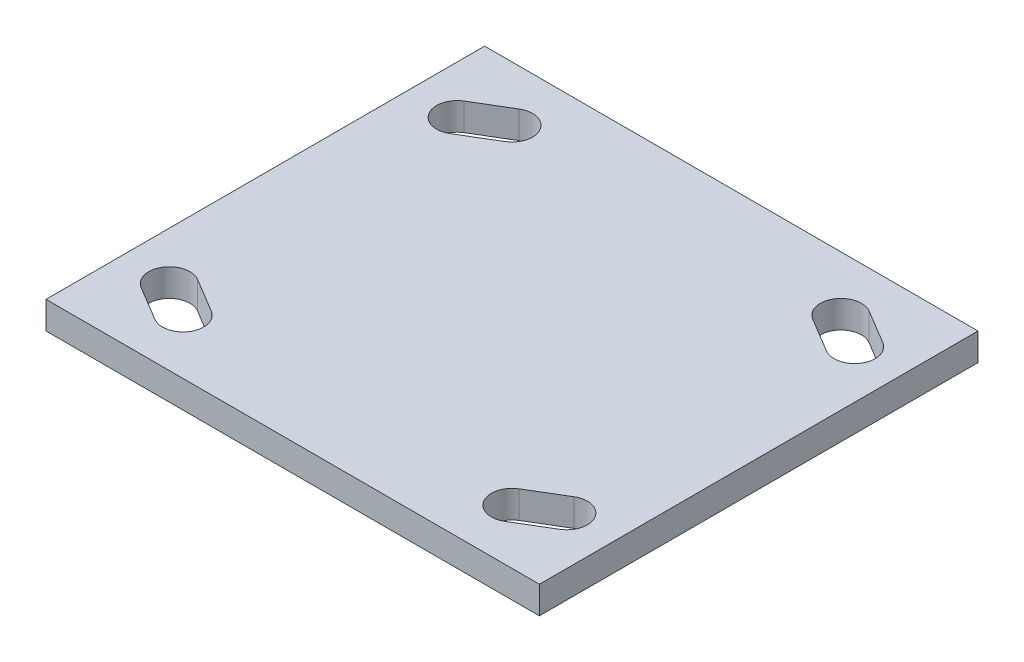
ISO-10303-21;
HEADER;
FILE_DESCRIPTION(('STEP AP214'),'2;1');
FILE_NAME('part.step','',(''),(''),'','','');
FILE_SCHEMA(('AUTOMOTIVE_DESIGN { 1 0 10303 214 1 1 1 1 }'));
ENDSEC;
DATA;
#1=APPLICATION_CONTEXT('core data for automotive mechanical design processes');
#2=APPLICATION_PROTOCOL_DEFINITION('international standard','automotive_design',2000,#1);
#3=PRODUCT_CONTEXT('',#1,'mechanical');
#4=PRODUCT('Part','Part','',(#3));
#5=PRODUCT_RELATED_PRODUCT_CATEGORY('part','',(#4));
#6=PRODUCT_DEFINITION_FORMATION('','',#4);
#7=PRODUCT_DEFINITION_CONTEXT('part definition',#1,'design');
#8=PRODUCT_DEFINITION('design','',#6,#7);
#9=PRODUCT_DEFINITION_SHAPE('','',#8);
#10=(LENGTH_UNIT() NAMED_UNIT(*) SI_UNIT(.MILLI.,.METRE.));
#11=(NAMED_UNIT(*) PLANE_ANGLE_UNIT() SI_UNIT($,.RADIAN.));
#12=(NAMED_UNIT(*) SI_UNIT($,.STERADIAN.) SOLID_ANGLE_UNIT());
#13=UNCERTAINTY_MEASURE_WITH_UNIT(LENGTH_MEASURE(1.E-05),#10,'distance_accuracy_value','');
#14=(GEOMETRIC_REPRESENTATION_CONTEXT(3) GLOBAL_UNCERTAINTY_ASSIGNED_CONTEXT((#13)) GLOBAL_UNIT_ASSIGNED_CONTEXT((#10,
#11,#12)) REPRESENTATION_CONTEXT('',''));
#15=CARTESIAN_POINT('',(0.,0.,0.));
#16=DIRECTION('',(0.,0.,1.));
#17=DIRECTION('',(1.,0.,0.));
#18=AXIS2_PLACEMENT_3D('',#15,#16,#17);
#19=CARTESIAN_POINT('',(-57.15,0.,50.8));
#20=DIRECTION('',(1.,0.,0.));
#21=DIRECTION('',(0.,0.,-1.));
#22=AXIS2_PLACEMENT_3D('',#19,#20,#21);
#23=PLANE('',#22);
#24=DIRECTION('',(0.,-1.,0.));
#25=VECTOR('',#24,1.);
#26=CARTESIAN_POINT('',(-57.15,0.,-50.8));
#27=LINE('',#26,#25);
#28=CARTESIAN_POINT('',(-57.15,0.,-50.8));
#29=VERTEX_POINT('',#28);
#30=CARTESIAN_POINT('',(-57.15,-6.35,-50.8));
#31=VERTEX_POINT('',#30);
#32=EDGE_CURVE('E298',#29,#31,#27,.T.);
#33=ORIENTED_EDGE('',*,*,#32,.T.);
#34=DIRECTION('',(0.,0.,-1.));
#35=VECTOR('',#34,1.);
#36=CARTESIAN_POINT('',(-57.15,-6.35,50.8));
#37=LINE('',#36,#35);
#38=CARTESIAN_POINT('',(-57.15,-6.35,50.8));
#39=VERTEX_POINT('',#38);
#40=EDGE_CURVE('E11',#39,#31,#37,.T.);
#41=ORIENTED_EDGE('',*,*,#40,.F.);
#42=DIRECTION('',(0.,-1.,0.));
#43=VECTOR('',#42,1.);
#44=CARTESIAN_POINT('',(-57.15,0.,50.8));
#45=LINE('',#44,#43);
#46=CARTESIAN_POINT('',(-57.15,0.,50.8));
#47=VERTEX_POINT('',#46);
#48=EDGE_CURVE('E305',#47,#39,#45,.T.);
#49=ORIENTED_EDGE('',*,*,#48,.F.);
#50=DIRECTION('',(0.,0.,-1.));
#51=VECTOR('',#50,1.);
#52=CARTESIAN_POINT('',(-57.15,0.,50.8));
#53=LINE('',#52,#51);
#54=EDGE_CURVE('E315',#47,#29,#53,.T.);
#55=ORIENTED_EDGE('',*,*,#54,.T.);
#56=EDGE_LOOP('',(#33,#41,#49,#55));
#57=FACE_BOUND('',#56,.T.);
#58=ADVANCED_FACE('F36',(#57),#23,.F.);
#59=CARTESIAN_POINT('',(-57.15,-6.35,50.8));
#60=DIRECTION('',(0.,1.,0.));
#61=DIRECTION('',(0.,0.,1.));
#62=AXIS2_PLACEMENT_3D('',#59,#60,#61);
#63=PLANE('',#62);
#64=DIRECTION('',(-0.857492925712546,0.,0.514495755427524));
#65=VECTOR('',#64,1.);
#66=CARTESIAN_POINT('',(35.6497139647764,-6.35,34.016189941294));
#67=LINE('',#66,#65);
#68=CARTESIAN_POINT('',(43.5872139647764,-6.35,29.253689941294));
#69=VERTEX_POINT('',#68);
#70=CARTESIAN_POINT('',(35.6497139647764,-6.35,34.016189941294));
#71=VERTEX_POINT('',#70);
#72=EDGE_CURVE('E180',#69,#71,#67,.T.);
#73=ORIENTED_EDGE('',*,*,#72,.T.);
#74=CARTESIAN_POINT('',(38.1,-6.35,38.1));
#75=DIRECTION('',(0.,1.,0.));
#76=DIRECTION('',(0.,0.,1.));
#77=AXIS2_PLACEMENT_3D('',#74,#75,#76);
#78=CIRCLE('',#77,4.76250000000001);
#79=CARTESIAN_POINT('',(40.5502860352236,-6.35,42.183810058706));
#80=VERTEX_POINT('',#79);
#81=EDGE_CURVE('E174',#71,#80,#78,.T.);
#82=ORIENTED_EDGE('',*,*,#81,.T.);
#83=DIRECTION('',(0.857492925712543,0.,-0.514495755427529));
#84=VECTOR('',#83,1.);
#85=CARTESIAN_POINT('',(40.5502860352236,-6.35,42.183810058706));
#86=LINE('',#85,#84);
#87=CARTESIAN_POINT('',(48.4877860352236,-6.35,37.421310058706));
#88=VERTEX_POINT('',#87);
#89=EDGE_CURVE('E183',#80,#88,#86,.T.);
#90=ORIENTED_EDGE('',*,*,#89,.T.);
#91=CARTESIAN_POINT('',(46.0375,-6.35,33.3375));
#92=DIRECTION('',(0.,1.,0.));
#93=DIRECTION('',(0.,0.,1.));
#94=AXIS2_PLACEMENT_3D('',#91,#92,#93);
#95=CIRCLE('',#94,4.76249999999998);
#96=EDGE_CURVE('E50',#88,#69,#95,.T.);
#97=ORIENTED_EDGE('',*,*,#96,.T.);
#98=EDGE_LOOP('',(#73,#82,#90,#97));
#99=FACE_BOUND('',#98,.T.);
#100=DIRECTION('',(-0.857492925712543,0.,-0.514495755427529));
#101=VECTOR('',#100,1.);
#102=CARTESIAN_POINT('',(40.5502860352236,-6.35,-42.183810058706));
#103=LINE('',#102,#101);
#104=CARTESIAN_POINT('',(48.4877860352236,-6.35,-37.421310058706));
#105=VERTEX_POINT('',#104);
#106=CARTESIAN_POINT('',(40.5502860352236,-6.35,-42.183810058706));
#107=VERTEX_POINT('',#106);
#108=EDGE_CURVE('E219',#105,#107,#103,.T.);
#109=ORIENTED_EDGE('',*,*,#108,.T.);
#110=CARTESIAN_POINT('',(38.1,-6.35,-38.1));
#111=DIRECTION('',(0.,1.,0.));
#112=DIRECTION('',(0.,0.,-1.));
#113=AXIS2_PLACEMENT_3D('',#110,#111,#112);
#114=CIRCLE('',#113,4.76250000000001);
#115=CARTESIAN_POINT('',(35.6497139647764,-6.35,-34.016189941294));
#116=VERTEX_POINT('',#115);
#117=EDGE_CURVE('E209',#107,#116,#114,.T.);
#118=ORIENTED_EDGE('',*,*,#117,.T.);
#119=DIRECTION('',(0.857492925712546,0.,0.514495755427524));
#120=VECTOR('',#119,1.);
#121=CARTESIAN_POINT('',(35.6497139647764,-6.35,-34.016189941294));
#122=LINE('',#121,#120);
#123=CARTESIAN_POINT('',(43.5872139647764,-6.35,-29.253689941294));
#124=VERTEX_POINT('',#123);
#125=EDGE_CURVE('E212',#116,#124,#122,.T.);
#126=ORIENTED_EDGE('',*,*,#125,.T.);
#127=CARTESIAN_POINT('',(46.0375,-6.35,-33.3375));
#128=DIRECTION('',(0.,1.,0.));
#129=DIRECTION('',(0.,0.,-1.));
#130=AXIS2_PLACEMENT_3D('',#127,#128,#129);
#131=CIRCLE('',#130,4.76249999999998);
#132=EDGE_CURVE('E216',#124,#105,#131,.T.);
#133=ORIENTED_EDGE('',*,*,#132,.T.);
#134=EDGE_LOOP('',(#109,#118,#126,#133));
#135=FACE_BOUND('',#134,.T.);
#136=DIRECTION('',(0.857492925712543,0.,0.514495755427529));
#137=VECTOR('',#136,1.);
#138=CARTESIAN_POINT('',(-40.5502860352236,-6.35,42.183810058706));
#139=LINE('',#138,#137);
#140=CARTESIAN_POINT('',(-48.4877860352236,-6.35,37.421310058706));
#141=VERTEX_POINT('',#140);
#142=CARTESIAN_POINT('',(-40.5502860352236,-6.35,42.183810058706));
#143=VERTEX_POINT('',#142);
#144=EDGE_CURVE('E251',#141,#143,#139,.T.);
#145=ORIENTED_EDGE('',*,*,#144,.T.);
#146=CARTESIAN_POINT('',(-38.1,-6.35,38.1));
#147=DIRECTION('',(0.,1.,0.));
#148=DIRECTION('',(0.,0.,-1.));
#149=AXIS2_PLACEMENT_3D('',#146,#147,#148);
#150=CIRCLE('',#149,4.76250000000001);
#151=CARTESIAN_POINT('',(-35.6497139647764,-6.35,34.016189941294));
#152=VERTEX_POINT('',#151);
#153=EDGE_CURVE('E241',#143,#152,#150,.T.);
#154=ORIENTED_EDGE('',*,*,#153,.T.);
#155=DIRECTION('',(-0.857492925712546,0.,-0.514495755427524));
#156=VECTOR('',#155,1.);
#157=CARTESIAN_POINT('',(-35.6497139647764,-6.35,34.016189941294));
#158=LINE('',#157,#156);
#159=CARTESIAN_POINT('',(-43.5872139647764,-6.35,29.253689941294));
#160=VERTEX_POINT('',#159);
#161=EDGE_CURVE('E244',#152,#160,#158,.T.);
#162=ORIENTED_EDGE('',*,*,#161,.T.);
#163=CARTESIAN_POINT('',(-46.0375,-6.35,33.3375));
#164=DIRECTION('',(0.,1.,0.));
#165=DIRECTION('',(0.,0.,-1.));
#166=AXIS2_PLACEMENT_3D('',#163,#164,#165);
#167=CIRCLE('',#166,4.76249999999998);
#168=EDGE_CURVE('E248',#160,#141,#167,.T.);
#169=ORIENTED_EDGE('',*,*,#168,.T.);
#170=EDGE_LOOP('',(#145,#154,#162,#169));
#171=FACE_BOUND('',#170,.T.);
#172=DIRECTION('',(0.857492925712546,0.,-0.514495755427524));
#173=VECTOR('',#172,1.);
#174=CARTESIAN_POINT('',(-35.6497139647764,-6.35,-34.016189941294));
#175=LINE('',#174,#173);
#176=CARTESIAN_POINT('',(-43.5872139647764,-6.35,-29.253689941294));
#177=VERTEX_POINT('',#176);
#178=CARTESIAN_POINT('',(-35.6497139647764,-6.35,-34.016189941294));
#179=VERTEX_POINT('',#178);
#180=EDGE_CURVE('E283',#177,#179,#175,.T.);
#181=ORIENTED_EDGE('',*,*,#180,.T.);
#182=CARTESIAN_POINT('',(-38.1,-6.35,-38.1));
#183=DIRECTION('',(0.,1.,0.));
#184=DIRECTION('',(0.,0.,1.));
#185=AXIS2_PLACEMENT_3D('',#182,#183,#184);
#186=CIRCLE('',#185,4.76250000000001);
#187=CARTESIAN_POINT('',(-40.5502860352236,-6.35,-42.183810058706));
#188=VERTEX_POINT('',#187);
#189=EDGE_CURVE('E273',#179,#188,#186,.T.);
#190=ORIENTED_EDGE('',*,*,#189,.T.);
#191=DIRECTION('',(-0.857492925712543,0.,0.514495755427529));
#192=VECTOR('',#191,1.);
#193=CARTESIAN_POINT('',(-40.5502860352236,-6.35,-42.183810058706));
#194=LINE('',#193,#192);
#195=CARTESIAN_POINT('',(-48.4877860352236,-6.35,-37.421310058706));
#196=VERTEX_POINT('',#195);
#197=EDGE_CURVE('E276',#188,#196,#194,.T.);
#198=ORIENTED_EDGE('',*,*,#197,.T.);
#199=CARTESIAN_POINT('',(-46.0375,-6.35,-33.3375));
#200=DIRECTION('',(0.,1.,0.));
#201=DIRECTION('',(0.,0.,1.));
#202=AXIS2_PLACEMENT_3D('',#199,#200,#201);
#203=CIRCLE('',#202,4.76249999999998);
#204=EDGE_CURVE('E280',#196,#177,#203,.T.);
#205=ORIENTED_EDGE('',*,*,#204,.T.);
#206=EDGE_LOOP('',(#181,#190,#198,#205));
#207=FACE_BOUND('',#206,.T.);
#208=DIRECTION('',(1.,0.,0.));
#209=VECTOR('',#208,1.);
#210=CARTESIAN_POINT('',(-57.15,-6.35,-50.8));
#211=LINE('',#210,#209);
#212=CARTESIAN_POINT('',(57.15,-6.35,-50.8));
#213=VERTEX_POINT('',#212);
#214=EDGE_CURVE('E318',#31,#213,#211,.T.);
#215=ORIENTED_EDGE('',*,*,#214,.T.);
#216=DIRECTION('',(0.,0.,-1.));
#217=VECTOR('',#216,1.);
#218=CARTESIAN_POINT('',(57.15,-6.35,50.8));
#219=LINE('',#218,#217);
#220=CARTESIAN_POINT('',(57.15,-6.35,50.8));
#221=VERTEX_POINT('',#220);
#222=EDGE_CURVE('E43',#221,#213,#219,.T.);
#223=ORIENTED_EDGE('',*,*,#222,.F.);
#224=DIRECTION('',(1.,0.,0.));
#225=VECTOR('',#224,1.);
#226=CARTESIAN_POINT('',(-57.15,-6.35,50.8));
#227=LINE('',#226,#225);
#228=EDGE_CURVE('E308',#39,#221,#227,.T.);
#229=ORIENTED_EDGE('',*,*,#228,.F.);
#230=ORIENTED_EDGE('',*,*,#40,.T.);
#231=EDGE_LOOP('',(#215,#223,#229,#230));
#232=FACE_BOUND('',#231,.T.);
#233=ADVANCED_FACE('F187',(#99,#135,#171,#207,#232),#63,.F.);
#234=CARTESIAN_POINT('',(57.15,0.,50.8));
#235=DIRECTION('',(-1.,0.,0.));
#236=DIRECTION('',(0.,0.,1.));
#237=AXIS2_PLACEMENT_3D('',#234,#235,#236);
#238=PLANE('',#237);
#239=DIRECTION('',(0.,1.,0.));
#240=VECTOR('',#239,1.);
#241=CARTESIAN_POINT('',(57.15,0.,-50.8));
#242=LINE('',#241,#240);
#243=CARTESIAN_POINT('',(57.15,0.,-50.8));
#244=VERTEX_POINT('',#243);
#245=EDGE_CURVE('E320',#213,#244,#242,.T.);
#246=ORIENTED_EDGE('',*,*,#245,.T.);
#247=DIRECTION('',(0.,0.,-1.));
#248=VECTOR('',#247,1.);
#249=CARTESIAN_POINT('',(57.15,0.,50.8));
#250=LINE('',#249,#248);
#251=CARTESIAN_POINT('',(57.15,0.,50.8));
#252=VERTEX_POINT('',#251);
#253=EDGE_CURVE('E325',#252,#244,#250,.T.);
#254=ORIENTED_EDGE('',*,*,#253,.F.);
#255=DIRECTION('',(0.,1.,0.));
#256=VECTOR('',#255,1.);
#257=CARTESIAN_POINT('',(57.15,0.,50.8));
#258=LINE('',#257,#256);
#259=EDGE_CURVE('E311',#221,#252,#258,.T.);
#260=ORIENTED_EDGE('',*,*,#259,.F.);
#261=ORIENTED_EDGE('',*,*,#222,.T.);
#262=EDGE_LOOP('',(#246,#254,#260,#261));
#263=FACE_BOUND('',#262,.T.);
#264=ADVANCED_FACE('F332',(#263),#238,.F.);
#265=CARTESIAN_POINT('',(-57.15,0.,50.8));
#266=DIRECTION('',(0.,-1.,0.));
#267=DIRECTION('',(0.,0.,-1.));
#268=AXIS2_PLACEMENT_3D('',#265,#266,#267);
#269=PLANE('',#268);
#270=DIRECTION('',(0.857492925712543,0.,-0.514495755427529));
#271=VECTOR('',#270,1.);
#272=CARTESIAN_POINT('',(40.5502860352236,0.,42.183810058706));
#273=LINE('',#272,#271);
#274=CARTESIAN_POINT('',(40.5502860352236,0.,42.183810058706));
#275=VERTEX_POINT('',#274);
#276=CARTESIAN_POINT('',(48.4877860352236,0.,37.421310058706));
#277=VERTEX_POINT('',#276);
#278=EDGE_CURVE('E199',#275,#277,#273,.T.);
#279=ORIENTED_EDGE('',*,*,#278,.F.);
#280=CARTESIAN_POINT('',(38.1,0.,38.1));
#281=DIRECTION('',(0.,1.,0.));
#282=DIRECTION('',(0.,0.,1.));
#283=AXIS2_PLACEMENT_3D('',#280,#281,#282);
#284=CIRCLE('',#283,4.76250000000001);
#285=CARTESIAN_POINT('',(35.6497139647764,0.,34.016189941294));
#286=VERTEX_POINT('',#285);
#287=EDGE_CURVE('E58',#286,#275,#284,.T.);
#288=ORIENTED_EDGE('',*,*,#287,.F.);
#289=DIRECTION('',(-0.857492925712546,0.,0.514495755427524));
#290=VECTOR('',#289,1.);
#291=CARTESIAN_POINT('',(35.6497139647764,0.,34.016189941294));
#292=LINE('',#291,#290);
#293=CARTESIAN_POINT('',(43.5872139647764,0.,29.253689941294));
#294=VERTEX_POINT('',#293);
#295=EDGE_CURVE('E190',#294,#286,#292,.T.);
#296=ORIENTED_EDGE('',*,*,#295,.F.);
#297=CARTESIAN_POINT('',(46.0375,0.,33.3375));
#298=DIRECTION('',(0.,1.,0.));
#299=DIRECTION('',(0.,0.,1.));
#300=AXIS2_PLACEMENT_3D('',#297,#298,#299);
#301=CIRCLE('',#300,4.76249999999998);
#302=EDGE_CURVE('E193',#277,#294,#301,.T.);
#303=ORIENTED_EDGE('',*,*,#302,.F.);
#304=EDGE_LOOP('',(#279,#288,#296,#303));
#305=FACE_BOUND('',#304,.T.);
#306=DIRECTION('',(0.857492925712546,0.,0.514495755427524));
#307=VECTOR('',#306,1.);
#308=CARTESIAN_POINT('',(35.6497139647764,0.,-34.016189941294));
#309=LINE('',#308,#307);
#310=CARTESIAN_POINT('',(35.6497139647764,0.,-34.016189941294));
#311=VERTEX_POINT('',#310);
#312=CARTESIAN_POINT('',(43.5872139647764,0.,-29.253689941294));
#313=VERTEX_POINT('',#312);
#314=EDGE_CURVE('E224',#311,#313,#309,.T.);
#315=ORIENTED_EDGE('',*,*,#314,.F.);
#316=CARTESIAN_POINT('',(38.1,0.,-38.1));
#317=DIRECTION('',(0.,1.,0.));
#318=DIRECTION('',(0.,0.,-1.));
#319=AXIS2_PLACEMENT_3D('',#316,#317,#318);
#320=CIRCLE('',#319,4.76250000000001);
#321=CARTESIAN_POINT('',(40.5502860352236,0.,-42.183810058706));
#322=VERTEX_POINT('',#321);
#323=EDGE_CURVE('E205',#322,#311,#320,.T.);
#324=ORIENTED_EDGE('',*,*,#323,.F.);
#325=DIRECTION('',(-0.857492925712543,0.,-0.514495755427529));
#326=VECTOR('',#325,1.);
#327=CARTESIAN_POINT('',(40.5502860352236,0.,-42.183810058706));
#328=LINE('',#327,#326);
#329=CARTESIAN_POINT('',(48.4877860352236,0.,-37.421310058706));
#330=VERTEX_POINT('',#329);
#331=EDGE_CURVE('E213',#330,#322,#328,.T.);
#332=ORIENTED_EDGE('',*,*,#331,.F.);
#333=CARTESIAN_POINT('',(46.0375,0.,-33.3375));
#334=DIRECTION('',(0.,1.,0.));
#335=DIRECTION('',(0.,0.,-1.));
#336=AXIS2_PLACEMENT_3D('',#333,#334,#335);
#337=CIRCLE('',#336,4.76249999999998);
#338=EDGE_CURVE('E227',#313,#330,#337,.T.);
#339=ORIENTED_EDGE('',*,*,#338,.F.);
#340=EDGE_LOOP('',(#315,#324,#332,#339));
#341=FACE_BOUND('',#340,.T.);
#342=DIRECTION('',(-0.857492925712546,0.,-0.514495755427524));
#343=VECTOR('',#342,1.);
#344=CARTESIAN_POINT('',(-35.6497139647764,0.,34.016189941294));
#345=LINE('',#344,#343);
#346=CARTESIAN_POINT('',(-35.6497139647764,0.,34.016189941294));
#347=VERTEX_POINT('',#346);
#348=CARTESIAN_POINT('',(-43.5872139647764,0.,29.253689941294));
#349=VERTEX_POINT('',#348);
#350=EDGE_CURVE('E256',#347,#349,#345,.T.);
#351=ORIENTED_EDGE('',*,*,#350,.F.);
#352=CARTESIAN_POINT('',(-38.1,0.,38.1));
#353=DIRECTION('',(0.,1.,0.));
#354=DIRECTION('',(0.,0.,-1.));
#355=AXIS2_PLACEMENT_3D('',#352,#353,#354);
#356=CIRCLE('',#355,4.76250000000001);
#357=CARTESIAN_POINT('',(-40.5502860352236,0.,42.183810058706));
#358=VERTEX_POINT('',#357);
#359=EDGE_CURVE('E234',#358,#347,#356,.T.);
#360=ORIENTED_EDGE('',*,*,#359,.F.);
#361=DIRECTION('',(0.857492925712543,0.,0.514495755427529));
#362=VECTOR('',#361,1.);
#363=CARTESIAN_POINT('',(-40.5502860352236,0.,42.183810058706));
#364=LINE('',#363,#362);
#365=CARTESIAN_POINT('',(-48.4877860352236,0.,37.421310058706));
#366=VERTEX_POINT('',#365);
#367=EDGE_CURVE('E245',#366,#358,#364,.T.);
#368=ORIENTED_EDGE('',*,*,#367,.F.);
#369=CARTESIAN_POINT('',(-46.0375,0.,33.3375));
#370=DIRECTION('',(0.,1.,0.));
#371=DIRECTION('',(0.,0.,-1.));
#372=AXIS2_PLACEMENT_3D('',#369,#370,#371);
#373=CIRCLE('',#372,4.76249999999998);
#374=EDGE_CURVE('E259',#349,#366,#373,.T.);
#375=ORIENTED_EDGE('',*,*,#374,.F.);
#376=EDGE_LOOP('',(#351,#360,#368,#375));
#377=FACE_BOUND('',#376,.T.);
#378=DIRECTION('',(-0.857492925712543,0.,0.514495755427529));
#379=VECTOR('',#378,1.);
#380=CARTESIAN_POINT('',(-40.5502860352236,0.,-42.183810058706));
#381=LINE('',#380,#379);
#382=CARTESIAN_POINT('',(-40.5502860352236,0.,-42.183810058706));
#383=VERTEX_POINT('',#382);
#384=CARTESIAN_POINT('',(-48.4877860352236,0.,-37.421310058706));
#385=VERTEX_POINT('',#384);
#386=EDGE_CURVE('E288',#383,#385,#381,.T.);
#387=ORIENTED_EDGE('',*,*,#386,.F.);
#388=CARTESIAN_POINT('',(-38.1,0.,-38.1));
#389=DIRECTION('',(0.,1.,0.));
#390=DIRECTION('',(0.,0.,1.));
#391=AXIS2_PLACEMENT_3D('',#388,#389,#390);
#392=CIRCLE('',#391,4.76250000000001);
#393=CARTESIAN_POINT('',(-35.6497139647764,0.,-34.016189941294));
#394=VERTEX_POINT('',#393);
#395=EDGE_CURVE('E266',#394,#383,#392,.T.);
#396=ORIENTED_EDGE('',*,*,#395,.F.);
#397=DIRECTION('',(0.857492925712546,0.,-0.514495755427524));
#398=VECTOR('',#397,1.);
#399=CARTESIAN_POINT('',(-35.6497139647764,0.,-34.016189941294));
#400=LINE('',#399,#398);
#401=CARTESIAN_POINT('',(-43.5872139647764,0.,-29.253689941294));
#402=VERTEX_POINT('',#401);
#403=EDGE_CURVE('E277',#402,#394,#400,.T.);
#404=ORIENTED_EDGE('',*,*,#403,.F.);
#405=CARTESIAN_POINT('',(-46.0375,0.,-33.3375));
#406=DIRECTION('',(0.,1.,0.));
#407=DIRECTION('',(0.,0.,1.));
#408=AXIS2_PLACEMENT_3D('',#405,#406,#407);
#409=CIRCLE('',#408,4.76249999999998);
#410=EDGE_CURVE('E291',#385,#402,#409,.T.);
#411=ORIENTED_EDGE('',*,*,#410,.F.);
#412=EDGE_LOOP('',(#387,#396,#404,#411));
#413=FACE_BOUND('',#412,.T.);
#414=DIRECTION('',(-1.,0.,0.));
#415=VECTOR('',#414,1.);
#416=CARTESIAN_POINT('',(-57.15,0.,-50.8));
#417=LINE('',#416,#415);
#418=EDGE_CURVE('E309',#244,#29,#417,.T.);
#419=ORIENTED_EDGE('',*,*,#418,.T.);
#420=ORIENTED_EDGE('',*,*,#54,.F.);
#421=DIRECTION('',(-1.,0.,0.));
#422=VECTOR('',#421,1.);
#423=CARTESIAN_POINT('',(-57.15,0.,50.8));
#424=LINE('',#423,#422);
#425=EDGE_CURVE('E313',#252,#47,#424,.T.);
#426=ORIENTED_EDGE('',*,*,#425,.F.);
#427=ORIENTED_EDGE('',*,*,#253,.T.);
#428=EDGE_LOOP('',(#419,#420,#426,#427));
#429=FACE_BOUND('',#428,.T.);
#430=ADVANCED_FACE('F341',(#305,#341,#377,#413,#429),#269,.F.);
#431=CARTESIAN_POINT('',(-57.15,-6.35,50.8));
#432=DIRECTION('',(0.,0.,1.));
#433=DIRECTION('',(1.,0.,0.));
#434=AXIS2_PLACEMENT_3D('',#431,#432,#433);
#435=PLANE('',#434);
#436=ORIENTED_EDGE('',*,*,#48,.T.);
#437=ORIENTED_EDGE('',*,*,#228,.T.);
#438=ORIENTED_EDGE('',*,*,#259,.T.);
#439=ORIENTED_EDGE('',*,*,#425,.T.);
#440=EDGE_LOOP('',(#436,#437,#438,#439));
#441=FACE_BOUND('',#440,.T.);
#442=ADVANCED_FACE('F347',(#441),#435,.T.);
#443=CARTESIAN_POINT('',(-57.15,-6.35,-50.8));
#444=DIRECTION('',(0.,0.,1.));
#445=DIRECTION('',(1.,0.,0.));
#446=AXIS2_PLACEMENT_3D('',#443,#444,#445);
#447=PLANE('',#446);
#448=ORIENTED_EDGE('',*,*,#32,.F.);
#449=ORIENTED_EDGE('',*,*,#418,.F.);
#450=ORIENTED_EDGE('',*,*,#245,.F.);
#451=ORIENTED_EDGE('',*,*,#214,.F.);
#452=EDGE_LOOP('',(#448,#449,#450,#451));
#453=FACE_BOUND('',#452,.T.);
#454=ADVANCED_FACE('F338',(#453),#447,.F.);
#455=CARTESIAN_POINT('',(-38.1,-6.35,-38.1));
#456=DIRECTION('',(0.,1.,0.));
#457=DIRECTION('',(0.,0.,1.));
#458=AXIS2_PLACEMENT_3D('',#455,#456,#457);
#459=CYLINDRICAL_SURFACE('',#458,4.76250000000001);
#460=ORIENTED_EDGE('',*,*,#395,.T.);
#461=DIRECTION('',(0.,1.,0.));
#462=VECTOR('',#461,1.);
#463=CARTESIAN_POINT('',(-40.5502860352236,-6.35,-42.183810058706));
#464=LINE('',#463,#462);
#465=EDGE_CURVE('E286',#188,#383,#464,.T.);
#466=ORIENTED_EDGE('',*,*,#465,.F.);
#467=ORIENTED_EDGE('',*,*,#189,.F.);
#468=DIRECTION('',(0.,1.,0.));
#469=VECTOR('',#468,1.);
#470=CARTESIAN_POINT('',(-35.6497139647764,-6.35,-34.016189941294));
#471=LINE('',#470,#469);
#472=EDGE_CURVE('E296',#179,#394,#471,.T.);
#473=ORIENTED_EDGE('',*,*,#472,.T.);
#474=EDGE_LOOP('',(#460,#466,#467,#473));
#475=FACE_BOUND('',#474,.T.);
#476=ADVANCED_FACE('F360',(#475),#459,.F.);
#477=CARTESIAN_POINT('',(-35.6497139647764,-6.35,-34.016189941294));
#478=DIRECTION('',(0.514495755427524,0.,0.857492925712546));
#479=DIRECTION('',(0.857492925712546,0.,-0.514495755427524));
#480=AXIS2_PLACEMENT_3D('',#477,#478,#479);
#481=PLANE('',#480);
#482=ORIENTED_EDGE('',*,*,#403,.T.);
#483=ORIENTED_EDGE('',*,*,#472,.F.);
#484=ORIENTED_EDGE('',*,*,#180,.F.);
#485=DIRECTION('',(0.,1.,0.));
#486=VECTOR('',#485,1.);
#487=CARTESIAN_POINT('',(-43.5872139647764,-6.35,-29.253689941294));
#488=LINE('',#487,#486);
#489=EDGE_CURVE('E299',#177,#402,#488,.T.);
#490=ORIENTED_EDGE('',*,*,#489,.T.);
#491=EDGE_LOOP('',(#482,#483,#484,#490));
#492=FACE_BOUND('',#491,.T.);
#493=ADVANCED_FACE('F365',(#492),#481,.F.);
#494=CARTESIAN_POINT('',(-46.0375,-6.35,-33.3375));
#495=DIRECTION('',(0.,1.,0.));
#496=DIRECTION('',(0.,0.,1.));
#497=AXIS2_PLACEMENT_3D('',#494,#495,#496);
#498=CYLINDRICAL_SURFACE('',#497,4.76249999999998);
#499=ORIENTED_EDGE('',*,*,#410,.T.);
#500=ORIENTED_EDGE('',*,*,#489,.F.);
#501=ORIENTED_EDGE('',*,*,#204,.F.);
#502=DIRECTION('',(0.,1.,0.));
#503=VECTOR('',#502,1.);
#504=CARTESIAN_POINT('',(-48.4877860352236,-6.35,-37.421310058706));
#505=LINE('',#504,#503);
#506=EDGE_CURVE('E301',#196,#385,#505,.T.);
#507=ORIENTED_EDGE('',*,*,#506,.T.);
#508=EDGE_LOOP('',(#499,#500,#501,#507));
#509=FACE_BOUND('',#508,.T.);
#510=ADVANCED_FACE('F371',(#509),#498,.F.);
#511=CARTESIAN_POINT('',(-40.5502860352236,-6.35,-42.183810058706));
#512=DIRECTION('',(-0.514495755427529,0.,-0.857492925712543));
#513=DIRECTION('',(-0.857492925712543,0.,0.514495755427529));
#514=AXIS2_PLACEMENT_3D('',#511,#512,#513);
#515=PLANE('',#514);
#516=ORIENTED_EDGE('',*,*,#386,.T.);
#517=ORIENTED_EDGE('',*,*,#506,.F.);
#518=ORIENTED_EDGE('',*,*,#197,.F.);
#519=ORIENTED_EDGE('',*,*,#465,.T.);
#520=EDGE_LOOP('',(#516,#517,#518,#519));
#521=FACE_BOUND('',#520,.T.);
#522=ADVANCED_FACE('F367',(#521),#515,.F.);
#523=CARTESIAN_POINT('',(-38.1,-6.35,38.1));
#524=DIRECTION('',(0.,1.,0.));
#525=DIRECTION('',(0.,0.,1.));
#526=AXIS2_PLACEMENT_3D('',#523,#524,#525);
#527=CYLINDRICAL_SURFACE('',#526,4.76250000000001);
#528=ORIENTED_EDGE('',*,*,#359,.T.);
#529=DIRECTION('',(0.,1.,0.));
#530=VECTOR('',#529,1.);
#531=CARTESIAN_POINT('',(-35.6497139647764,-6.35,34.016189941294));
#532=LINE('',#531,#530);
#533=EDGE_CURVE('E254',#152,#347,#532,.T.);
#534=ORIENTED_EDGE('',*,*,#533,.F.);
#535=ORIENTED_EDGE('',*,*,#153,.F.);
#536=DIRECTION('',(0.,1.,0.));
#537=VECTOR('',#536,1.);
#538=CARTESIAN_POINT('',(-40.5502860352236,-6.35,42.183810058706));
#539=LINE('',#538,#537);
#540=EDGE_CURVE('E264',#143,#358,#539,.T.);
#541=ORIENTED_EDGE('',*,*,#540,.T.);
#542=EDGE_LOOP('',(#528,#534,#535,#541));
#543=FACE_BOUND('',#542,.T.);
#544=ADVANCED_FACE('F370',(#543),#527,.F.);
#545=CARTESIAN_POINT('',(-40.5502860352236,-6.35,42.183810058706));
#546=DIRECTION('',(-0.514495755427529,0.,0.857492925712543));
#547=DIRECTION('',(0.857492925712543,0.,0.514495755427529));
#548=AXIS2_PLACEMENT_3D('',#545,#546,#547);
#549=PLANE('',#548);
#550=ORIENTED_EDGE('',*,*,#367,.T.);
#551=ORIENTED_EDGE('',*,*,#540,.F.);
#552=ORIENTED_EDGE('',*,*,#144,.F.);
#553=DIRECTION('',(0.,1.,0.));
#554=VECTOR('',#553,1.);
#555=CARTESIAN_POINT('',(-48.4877860352236,-6.35,37.421310058706));
#556=LINE('',#555,#554);
#557=EDGE_CURVE('E267',#141,#366,#556,.T.);
#558=ORIENTED_EDGE('',*,*,#557,.T.);
#559=EDGE_LOOP('',(#550,#551,#552,#558));
#560=FACE_BOUND('',#559,.T.);
#561=ADVANCED_FACE('F381',(#560),#549,.F.);
#562=CARTESIAN_POINT('',(-46.0375,-6.35,33.3375));
#563=DIRECTION('',(0.,1.,0.));
#564=DIRECTION('',(0.,0.,1.));
#565=AXIS2_PLACEMENT_3D('',#562,#563,#564);
#566=CYLINDRICAL_SURFACE('',#565,4.76249999999998);
#567=ORIENTED_EDGE('',*,*,#374,.T.);
#568=ORIENTED_EDGE('',*,*,#557,.F.);
#569=ORIENTED_EDGE('',*,*,#168,.F.);
#570=DIRECTION('',(0.,1.,0.));
#571=VECTOR('',#570,1.);
#572=CARTESIAN_POINT('',(-43.5872139647764,-6.35,29.253689941294));
#573=LINE('',#572,#571);
#574=EDGE_CURVE('E269',#160,#349,#573,.T.);
#575=ORIENTED_EDGE('',*,*,#574,.T.);
#576=EDGE_LOOP('',(#567,#568,#569,#575));
#577=FACE_BOUND('',#576,.T.);
#578=ADVANCED_FACE('F387',(#577),#566,.F.);
#579=CARTESIAN_POINT('',(-35.6497139647764,-6.35,34.016189941294));
#580=DIRECTION('',(0.514495755427524,0.,-0.857492925712546));
#581=DIRECTION('',(-0.857492925712546,0.,-0.514495755427524));
#582=AXIS2_PLACEMENT_3D('',#579,#580,#581);
#583=PLANE('',#582);
#584=ORIENTED_EDGE('',*,*,#350,.T.);
#585=ORIENTED_EDGE('',*,*,#574,.F.);
#586=ORIENTED_EDGE('',*,*,#161,.F.);
#587=ORIENTED_EDGE('',*,*,#533,.T.);
#588=EDGE_LOOP('',(#584,#585,#586,#587));
#589=FACE_BOUND('',#588,.T.);
#590=ADVANCED_FACE('F383',(#589),#583,.F.);
#591=CARTESIAN_POINT('',(38.1,-6.35,-38.1));
#592=DIRECTION('',(0.,1.,0.));
#593=DIRECTION('',(0.,0.,1.));
#594=AXIS2_PLACEMENT_3D('',#591,#592,#593);
#595=CYLINDRICAL_SURFACE('',#594,4.76250000000001);
#596=ORIENTED_EDGE('',*,*,#323,.T.);
#597=DIRECTION('',(0.,1.,0.));
#598=VECTOR('',#597,1.);
#599=CARTESIAN_POINT('',(35.6497139647764,-6.35,-34.016189941294));
#600=LINE('',#599,#598);
#601=EDGE_CURVE('E222',#116,#311,#600,.T.);
#602=ORIENTED_EDGE('',*,*,#601,.F.);
#603=ORIENTED_EDGE('',*,*,#117,.F.);
#604=DIRECTION('',(0.,1.,0.));
#605=VECTOR('',#604,1.);
#606=CARTESIAN_POINT('',(40.5502860352236,-6.35,-42.183810058706));
#607=LINE('',#606,#605);
#608=EDGE_CURVE('E232',#107,#322,#607,.T.);
#609=ORIENTED_EDGE('',*,*,#608,.T.);
#610=EDGE_LOOP('',(#596,#602,#603,#609));
#611=FACE_BOUND('',#610,.T.);
#612=ADVANCED_FACE('F386',(#611),#595,.F.);
#613=CARTESIAN_POINT('',(40.5502860352236,-6.35,-42.183810058706));
#614=DIRECTION('',(0.514495755427529,0.,-0.857492925712543));
#615=DIRECTION('',(-0.857492925712543,0.,-0.514495755427529));
#616=AXIS2_PLACEMENT_3D('',#613,#614,#615);
#617=PLANE('',#616);
#618=ORIENTED_EDGE('',*,*,#331,.T.);
#619=ORIENTED_EDGE('',*,*,#608,.F.);
#620=ORIENTED_EDGE('',*,*,#108,.F.);
#621=DIRECTION('',(0.,1.,0.));
#622=VECTOR('',#621,1.);
#623=CARTESIAN_POINT('',(48.4877860352236,-6.35,-37.421310058706));
#624=LINE('',#623,#622);
#625=EDGE_CURVE('E235',#105,#330,#624,.T.);
#626=ORIENTED_EDGE('',*,*,#625,.T.);
#627=EDGE_LOOP('',(#618,#619,#620,#626));
#628=FACE_BOUND('',#627,.T.);
#629=ADVANCED_FACE('F397',(#628),#617,.F.);
#630=CARTESIAN_POINT('',(46.0375,-6.35,-33.3375));
#631=DIRECTION('',(0.,1.,0.));
#632=DIRECTION('',(0.,0.,1.));
#633=AXIS2_PLACEMENT_3D('',#630,#631,#632);
#634=CYLINDRICAL_SURFACE('',#633,4.76249999999998);
#635=ORIENTED_EDGE('',*,*,#338,.T.);
#636=ORIENTED_EDGE('',*,*,#625,.F.);
#637=ORIENTED_EDGE('',*,*,#132,.F.);
#638=DIRECTION('',(0.,1.,0.));
#639=VECTOR('',#638,1.);
#640=CARTESIAN_POINT('',(43.5872139647764,-6.35,-29.253689941294));
#641=LINE('',#640,#639);
#642=EDGE_CURVE('E237',#124,#313,#641,.T.);
#643=ORIENTED_EDGE('',*,*,#642,.T.);
#644=EDGE_LOOP('',(#635,#636,#637,#643));
#645=FACE_BOUND('',#644,.T.);
#646=ADVANCED_FACE('F402',(#645),#634,.F.);
#647=CARTESIAN_POINT('',(35.6497139647764,-6.35,-34.016189941294));
#648=DIRECTION('',(-0.514495755427524,0.,0.857492925712546));
#649=DIRECTION('',(0.857492925712546,0.,0.514495755427524));
#650=AXIS2_PLACEMENT_3D('',#647,#648,#649);
#651=PLANE('',#650);
#652=ORIENTED_EDGE('',*,*,#314,.T.);
#653=ORIENTED_EDGE('',*,*,#642,.F.);
#654=ORIENTED_EDGE('',*,*,#125,.F.);
#655=ORIENTED_EDGE('',*,*,#601,.T.);
#656=EDGE_LOOP('',(#652,#653,#654,#655));
#657=FACE_BOUND('',#656,.T.);
#658=ADVANCED_FACE('F399',(#657),#651,.F.);
#659=CARTESIAN_POINT('',(38.1,-6.35,38.1));
#660=DIRECTION('',(0.,1.,0.));
#661=DIRECTION('',(0.,0.,1.));
#662=AXIS2_PLACEMENT_3D('',#659,#660,#661);
#663=CYLINDRICAL_SURFACE('',#662,4.76250000000001);
#664=ORIENTED_EDGE('',*,*,#287,.T.);
#665=DIRECTION('',(0.,1.,0.));
#666=VECTOR('',#665,1.);
#667=CARTESIAN_POINT('',(40.5502860352236,-6.35,42.183810058706));
#668=LINE('',#667,#666);
#669=EDGE_CURVE('E170',#80,#275,#668,.T.);
#670=ORIENTED_EDGE('',*,*,#669,.F.);
#671=ORIENTED_EDGE('',*,*,#81,.F.);
#672=DIRECTION('',(0.,1.,0.));
#673=VECTOR('',#672,1.);
#674=CARTESIAN_POINT('',(35.6497139647764,-6.35,34.016189941294));
#675=LINE('',#674,#673);
#676=EDGE_CURVE('E203',#71,#286,#675,.T.);
#677=ORIENTED_EDGE('',*,*,#676,.T.);
#678=EDGE_LOOP('',(#664,#670,#671,#677));
#679=FACE_BOUND('',#678,.T.);
#680=ADVANCED_FACE('F172',(#679),#663,.F.);
#681=CARTESIAN_POINT('',(35.6497139647764,-6.35,34.016189941294));
#682=DIRECTION('',(-0.514495755427524,0.,-0.857492925712546));
#683=DIRECTION('',(-0.857492925712546,0.,0.514495755427524));
#684=AXIS2_PLACEMENT_3D('',#681,#682,#683);
#685=PLANE('',#684);
#686=ORIENTED_EDGE('',*,*,#295,.T.);
#687=ORIENTED_EDGE('',*,*,#676,.F.);
#688=ORIENTED_EDGE('',*,*,#72,.F.);
#689=DIRECTION('',(0.,1.,0.));
#690=VECTOR('',#689,1.);
#691=CARTESIAN_POINT('',(43.5872139647764,-6.35,29.253689941294));
#692=LINE('',#691,#690);
#693=EDGE_CURVE('E206',#69,#294,#692,.T.);
#694=ORIENTED_EDGE('',*,*,#693,.T.);
#695=EDGE_LOOP('',(#686,#687,#688,#694));
#696=FACE_BOUND('',#695,.T.);
#697=ADVANCED_FACE('F412',(#696),#685,.F.);
#698=CARTESIAN_POINT('',(46.0375,-6.35,33.3375));
#699=DIRECTION('',(0.,1.,0.));
#700=DIRECTION('',(0.,0.,1.));
#701=AXIS2_PLACEMENT_3D('',#698,#699,#700);
#702=CYLINDRICAL_SURFACE('',#701,4.76249999999998);
#703=ORIENTED_EDGE('',*,*,#302,.T.);
#704=ORIENTED_EDGE('',*,*,#693,.F.);
#705=ORIENTED_EDGE('',*,*,#96,.F.);
#706=DIRECTION('',(0.,1.,0.));
#707=VECTOR('',#706,1.);
#708=CARTESIAN_POINT('',(48.4877860352236,-6.35,37.421310058706));
#709=LINE('',#708,#707);
#710=EDGE_CURVE('E179',#88,#277,#709,.T.);
#711=ORIENTED_EDGE('',*,*,#710,.T.);
#712=EDGE_LOOP('',(#703,#704,#705,#711));
#713=FACE_BOUND('',#712,.T.);
#714=ADVANCED_FACE('F415',(#713),#702,.F.);
#715=CARTESIAN_POINT('',(40.5502860352236,-6.35,42.183810058706));
#716=DIRECTION('',(0.514495755427529,0.,0.857492925712543));
#717=DIRECTION('',(0.857492925712543,0.,-0.514495755427529));
#718=AXIS2_PLACEMENT_3D('',#715,#716,#717);
#719=PLANE('',#718);
#720=ORIENTED_EDGE('',*,*,#278,.T.);
#721=ORIENTED_EDGE('',*,*,#710,.F.);
#722=ORIENTED_EDGE('',*,*,#89,.F.);
#723=ORIENTED_EDGE('',*,*,#669,.T.);
#724=EDGE_LOOP('',(#720,#721,#722,#723));
#725=FACE_BOUND('',#724,.T.);
#726=ADVANCED_FACE('F184',(#725),#719,.F.);
#727=CLOSED_SHELL('',(#58,#233,#264,#430,#442,#454,#476,#493,#510,#522,#544,#561,#578,#590,#612,
#629,#646,#658,#680,#697,#714,#726));
#728=MANIFOLD_SOLID_BREP('B2',#727);
#729=ADVANCED_BREP_SHAPE_REPRESENTATION('',(#18,#728),#14);
#730=SHAPE_DEFINITION_REPRESENTATION(#9,#729);
ENDSEC;
END-ISO-10303-21;
